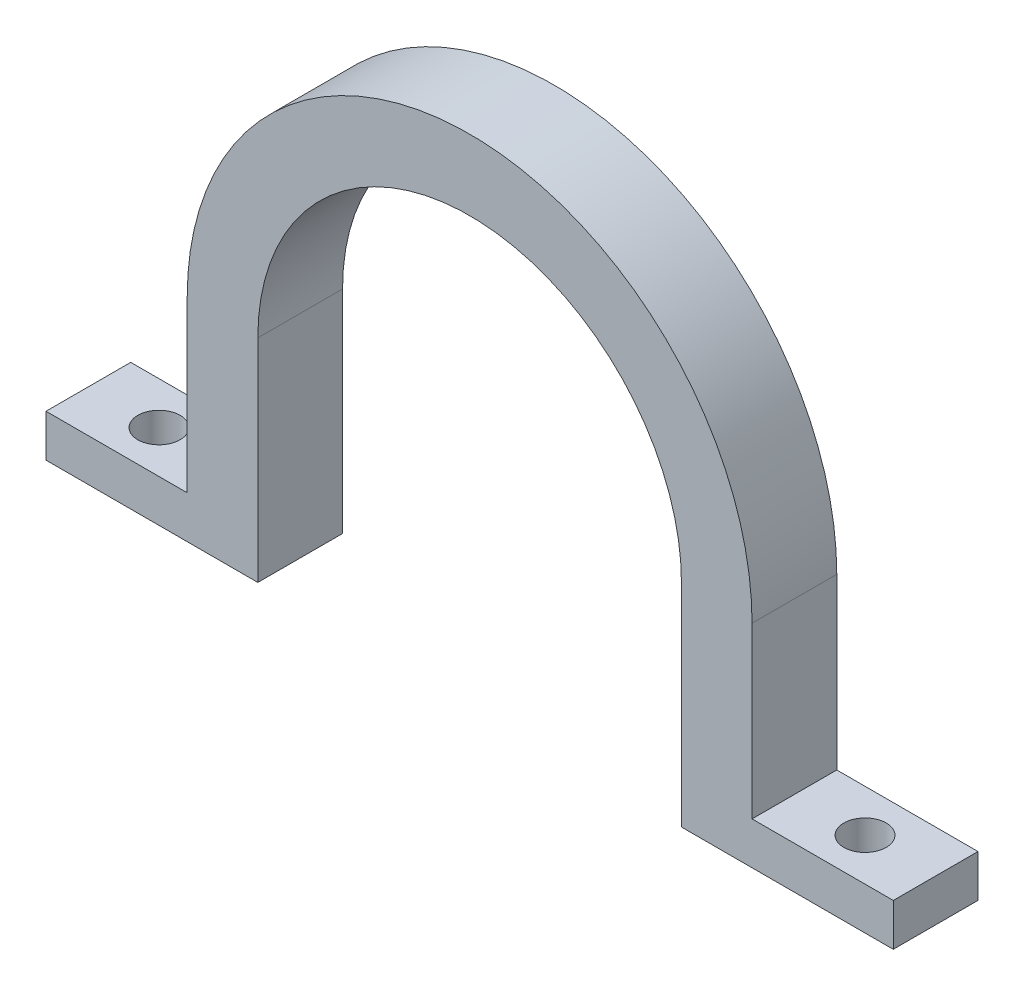
ISO-10303-21;
HEADER;
FILE_DESCRIPTION(('STEP AP214'),'2;1');
FILE_NAME('part.step','',(''),(''),'','','');
FILE_SCHEMA(('AUTOMOTIVE_DESIGN { 1 0 10303 214 1 1 1 1 }'));
ENDSEC;
DATA;
#1=APPLICATION_CONTEXT('core data for automotive mechanical design processes');
#2=APPLICATION_PROTOCOL_DEFINITION('international standard','automotive_design',2000,#1);
#3=PRODUCT_CONTEXT('',#1,'mechanical');
#4=PRODUCT('Part','Part','',(#3));
#5=PRODUCT_RELATED_PRODUCT_CATEGORY('part','',(#4));
#6=PRODUCT_DEFINITION_FORMATION('','',#4);
#7=PRODUCT_DEFINITION_CONTEXT('part definition',#1,'design');
#8=PRODUCT_DEFINITION('design','',#6,#7);
#9=PRODUCT_DEFINITION_SHAPE('','',#8);
#10=(LENGTH_UNIT() NAMED_UNIT(*) SI_UNIT(.MILLI.,.METRE.));
#11=(NAMED_UNIT(*) PLANE_ANGLE_UNIT() SI_UNIT($,.RADIAN.));
#12=(NAMED_UNIT(*) SI_UNIT($,.STERADIAN.) SOLID_ANGLE_UNIT());
#13=UNCERTAINTY_MEASURE_WITH_UNIT(LENGTH_MEASURE(1.E-05),#10,'distance_accuracy_value','');
#14=(GEOMETRIC_REPRESENTATION_CONTEXT(3) GLOBAL_UNCERTAINTY_ASSIGNED_CONTEXT((#13)) GLOBAL_UNIT_ASSIGNED_CONTEXT((#10,
#11,#12)) REPRESENTATION_CONTEXT('',''));
#15=CARTESIAN_POINT('',(0.,0.,0.));
#16=DIRECTION('',(0.,0.,1.));
#17=DIRECTION('',(1.,0.,0.));
#18=AXIS2_PLACEMENT_3D('',#15,#16,#17);
#19=CARTESIAN_POINT('',(15.,0.,6.));
#20=DIRECTION('',(1.,0.,0.));
#21=DIRECTION('',(0.,1.,0.));
#22=AXIS2_PLACEMENT_3D('',#19,#20,#21);
#23=PLANE('',#22);
#24=DIRECTION('',(0.,-1.,0.));
#25=VECTOR('',#24,1.);
#26=CARTESIAN_POINT('',(15.,0.,0.));
#27=LINE('',#26,#25);
#28=CARTESIAN_POINT('',(15.,0.,0.));
#29=VERTEX_POINT('',#28);
#30=CARTESIAN_POINT('',(15.0000000000001,-15.,0.));
#31=VERTEX_POINT('',#30);
#32=EDGE_CURVE('E156',#29,#31,#27,.T.);
#33=ORIENTED_EDGE('',*,*,#32,.T.);
#34=DIRECTION('',(0.,0.,-1.));
#35=VECTOR('',#34,1.);
#36=CARTESIAN_POINT('',(15.0000000000001,-15.,6.));
#37=LINE('',#36,#35);
#38=CARTESIAN_POINT('',(15.0000000000001,-15.,6.));
#39=VERTEX_POINT('',#38);
#40=EDGE_CURVE('E11',#39,#31,#37,.T.);
#41=ORIENTED_EDGE('',*,*,#40,.F.);
#42=DIRECTION('',(0.,-1.,0.));
#43=VECTOR('',#42,1.);
#44=CARTESIAN_POINT('',(15.,0.,6.));
#45=LINE('',#44,#43);
#46=CARTESIAN_POINT('',(15.,0.,6.));
#47=VERTEX_POINT('',#46);
#48=EDGE_CURVE('E188',#47,#39,#45,.T.);
#49=ORIENTED_EDGE('',*,*,#48,.F.);
#50=DIRECTION('',(0.,0.,-1.));
#51=VECTOR('',#50,1.);
#52=CARTESIAN_POINT('',(15.,0.,6.));
#53=LINE('',#52,#51);
#54=EDGE_CURVE('E51',#47,#29,#53,.T.);
#55=ORIENTED_EDGE('',*,*,#54,.T.);
#56=EDGE_LOOP('',(#33,#41,#49,#55));
#57=FACE_BOUND('',#56,.T.);
#58=ADVANCED_FACE('F35',(#57),#23,.F.);
#59=CARTESIAN_POINT('',(15.0000000000001,-15.,6.));
#60=DIRECTION('',(0.,1.,0.));
#61=DIRECTION('',(0.,0.,1.));
#62=AXIS2_PLACEMENT_3D('',#59,#60,#61);
#63=PLANE('',#62);
#64=CARTESIAN_POINT('',(25.,-15.,3.));
#65=DIRECTION('',(0.,1.,0.));
#66=DIRECTION('',(0.,0.,1.));
#67=AXIS2_PLACEMENT_3D('',#64,#65,#66);
#68=CIRCLE('',#67,1.5);
#69=CARTESIAN_POINT('',(25.,-15.,4.5));
#70=VERTEX_POINT('',#69);
#71=EDGE_CURVE('E296',#70,#70,#68,.T.);
#72=ORIENTED_EDGE('',*,*,#71,.T.);
#73=EDGE_LOOP('',(#72));
#74=FACE_BOUND('',#73,.T.);
#75=DIRECTION('',(1.,0.,0.));
#76=VECTOR('',#75,1.);
#77=CARTESIAN_POINT('',(15.0000000000001,-15.,0.));
#78=LINE('',#77,#76);
#79=CARTESIAN_POINT('',(30.,-15.,0.));
#80=VERTEX_POINT('',#79);
#81=EDGE_CURVE('E158',#31,#80,#78,.T.);
#82=ORIENTED_EDGE('',*,*,#81,.T.);
#83=DIRECTION('',(0.,0.,-1.));
#84=VECTOR('',#83,1.);
#85=CARTESIAN_POINT('',(30.,-15.,6.));
#86=LINE('',#85,#84);
#87=CARTESIAN_POINT('',(30.,-15.,6.));
#88=VERTEX_POINT('',#87);
#89=EDGE_CURVE('E43',#88,#80,#86,.T.);
#90=ORIENTED_EDGE('',*,*,#89,.F.);
#91=DIRECTION('',(1.,0.,0.));
#92=VECTOR('',#91,1.);
#93=CARTESIAN_POINT('',(15.0000000000001,-15.,6.));
#94=LINE('',#93,#92);
#95=EDGE_CURVE('E101',#39,#88,#94,.T.);
#96=ORIENTED_EDGE('',*,*,#95,.F.);
#97=ORIENTED_EDGE('',*,*,#40,.T.);
#98=EDGE_LOOP('',(#82,#90,#96,#97));
#99=FACE_BOUND('',#98,.T.);
#100=ADVANCED_FACE('F210',(#74,#99),#63,.F.);
#101=CARTESIAN_POINT('',(30.,-12.,6.));
#102=DIRECTION('',(1.,0.,0.));
#103=DIRECTION('',(0.,0.,-1.));
#104=AXIS2_PLACEMENT_3D('',#101,#102,#103);
#105=PLANE('',#104);
#106=DIRECTION('',(0.,-1.,0.));
#107=VECTOR('',#106,1.);
#108=CARTESIAN_POINT('',(30.,-12.,0.));
#109=LINE('',#108,#107);
#110=CARTESIAN_POINT('',(30.,-12.,0.));
#111=VERTEX_POINT('',#110);
#112=EDGE_CURVE('E162',#111,#80,#109,.T.);
#113=ORIENTED_EDGE('',*,*,#112,.F.);
#114=DIRECTION('',(0.,0.,-1.));
#115=VECTOR('',#114,1.);
#116=CARTESIAN_POINT('',(30.,-12.,6.));
#117=LINE('',#116,#115);
#118=CARTESIAN_POINT('',(30.,-12.,6.));
#119=VERTEX_POINT('',#118);
#120=EDGE_CURVE('E203',#119,#111,#117,.T.);
#121=ORIENTED_EDGE('',*,*,#120,.F.);
#122=DIRECTION('',(0.,-1.,0.));
#123=VECTOR('',#122,1.);
#124=CARTESIAN_POINT('',(30.,-12.,6.));
#125=LINE('',#124,#123);
#126=EDGE_CURVE('E209',#119,#88,#125,.T.);
#127=ORIENTED_EDGE('',*,*,#126,.T.);
#128=ORIENTED_EDGE('',*,*,#89,.T.);
#129=EDGE_LOOP('',(#113,#121,#127,#128));
#130=FACE_BOUND('',#129,.T.);
#131=ADVANCED_FACE('F207',(#130),#105,.T.);
#132=CARTESIAN_POINT('',(30.,-12.,6.));
#133=DIRECTION('',(0.,-1.,0.));
#134=DIRECTION('',(0.,0.,-1.));
#135=AXIS2_PLACEMENT_3D('',#132,#133,#134);
#136=PLANE('',#135);
#137=CARTESIAN_POINT('',(25.,-12.,3.));
#138=DIRECTION('',(0.,1.,0.));
#139=DIRECTION('',(0.,0.,1.));
#140=AXIS2_PLACEMENT_3D('',#137,#138,#139);
#141=CIRCLE('',#140,1.5);
#142=CARTESIAN_POINT('',(25.,-12.,4.5));
#143=VERTEX_POINT('',#142);
#144=EDGE_CURVE('E292',#143,#143,#141,.T.);
#145=ORIENTED_EDGE('',*,*,#144,.F.);
#146=EDGE_LOOP('',(#145));
#147=FACE_BOUND('',#146,.T.);
#148=DIRECTION('',(-1.,0.,0.));
#149=VECTOR('',#148,1.);
#150=CARTESIAN_POINT('',(30.,-12.,0.));
#151=LINE('',#150,#149);
#152=CARTESIAN_POINT('',(20.,-12.,0.));
#153=VERTEX_POINT('',#152);
#154=EDGE_CURVE('E165',#111,#153,#151,.T.);
#155=ORIENTED_EDGE('',*,*,#154,.T.);
#156=DIRECTION('',(0.,0.,-1.));
#157=VECTOR('',#156,1.);
#158=CARTESIAN_POINT('',(20.,-12.,6.));
#159=LINE('',#158,#157);
#160=CARTESIAN_POINT('',(20.,-12.,6.));
#161=VERTEX_POINT('',#160);
#162=EDGE_CURVE('E201',#161,#153,#159,.T.);
#163=ORIENTED_EDGE('',*,*,#162,.F.);
#164=DIRECTION('',(-1.,0.,0.));
#165=VECTOR('',#164,1.);
#166=CARTESIAN_POINT('',(30.,-12.,6.));
#167=LINE('',#166,#165);
#168=EDGE_CURVE('E222',#119,#161,#167,.T.);
#169=ORIENTED_EDGE('',*,*,#168,.F.);
#170=ORIENTED_EDGE('',*,*,#120,.T.);
#171=EDGE_LOOP('',(#155,#163,#169,#170));
#172=FACE_BOUND('',#171,.T.);
#173=ADVANCED_FACE('F219',(#147,#172),#136,.F.);
#174=CARTESIAN_POINT('',(20.,0.,6.));
#175=DIRECTION('',(1.,0.,0.));
#176=DIRECTION('',(0.,1.,0.));
#177=AXIS2_PLACEMENT_3D('',#174,#175,#176);
#178=PLANE('',#177);
#179=DIRECTION('',(0.,-1.,0.));
#180=VECTOR('',#179,1.);
#181=CARTESIAN_POINT('',(20.,0.,0.));
#182=LINE('',#181,#180);
#183=CARTESIAN_POINT('',(20.,0.,0.));
#184=VERTEX_POINT('',#183);
#185=EDGE_CURVE('E168',#184,#153,#182,.T.);
#186=ORIENTED_EDGE('',*,*,#185,.F.);
#187=DIRECTION('',(0.,0.,-1.));
#188=VECTOR('',#187,1.);
#189=CARTESIAN_POINT('',(20.,0.,6.));
#190=LINE('',#189,#188);
#191=CARTESIAN_POINT('',(20.,0.,6.));
#192=VERTEX_POINT('',#191);
#193=EDGE_CURVE('E199',#192,#184,#190,.T.);
#194=ORIENTED_EDGE('',*,*,#193,.F.);
#195=DIRECTION('',(0.,-1.,0.));
#196=VECTOR('',#195,1.);
#197=CARTESIAN_POINT('',(20.,0.,6.));
#198=LINE('',#197,#196);
#199=EDGE_CURVE('E224',#192,#161,#198,.T.);
#200=ORIENTED_EDGE('',*,*,#199,.T.);
#201=ORIENTED_EDGE('',*,*,#162,.T.);
#202=EDGE_LOOP('',(#186,#194,#200,#201));
#203=FACE_BOUND('',#202,.T.);
#204=ADVANCED_FACE('F305',(#203),#178,.T.);
#205=CARTESIAN_POINT('',(0.,0.,6.));
#206=DIRECTION('',(0.,0.,-1.));
#207=DIRECTION('',(-1.,0.,0.));
#208=AXIS2_PLACEMENT_3D('',#205,#206,#207);
#209=CYLINDRICAL_SURFACE('',#208,20.);
#210=CARTESIAN_POINT('',(0.,0.,0.));
#211=DIRECTION('',(0.,0.,1.));
#212=DIRECTION('',(1.,0.,0.));
#213=AXIS2_PLACEMENT_3D('',#210,#211,#212);
#214=CIRCLE('',#213,20.);
#215=CARTESIAN_POINT('',(-20.,0.,0.));
#216=VERTEX_POINT('',#215);
#217=EDGE_CURVE('E171',#184,#216,#214,.T.);
#218=ORIENTED_EDGE('',*,*,#217,.T.);
#219=DIRECTION('',(0.,0.,-1.));
#220=VECTOR('',#219,1.);
#221=CARTESIAN_POINT('',(-20.,0.,6.));
#222=LINE('',#221,#220);
#223=CARTESIAN_POINT('',(-20.,0.,6.));
#224=VERTEX_POINT('',#223);
#225=EDGE_CURVE('E196',#224,#216,#222,.T.);
#226=ORIENTED_EDGE('',*,*,#225,.F.);
#227=CARTESIAN_POINT('',(0.,0.,6.));
#228=DIRECTION('',(0.,0.,1.));
#229=DIRECTION('',(1.,0.,0.));
#230=AXIS2_PLACEMENT_3D('',#227,#228,#229);
#231=CIRCLE('',#230,20.);
#232=EDGE_CURVE('E231',#192,#224,#231,.T.);
#233=ORIENTED_EDGE('',*,*,#232,.F.);
#234=ORIENTED_EDGE('',*,*,#193,.T.);
#235=EDGE_LOOP('',(#218,#226,#233,#234));
#236=FACE_BOUND('',#235,.T.);
#237=ADVANCED_FACE('F311',(#236),#209,.T.);
#238=CARTESIAN_POINT('',(-20.,0.,6.));
#239=DIRECTION('',(1.,0.,0.));
#240=DIRECTION('',(0.,1.,0.));
#241=AXIS2_PLACEMENT_3D('',#238,#239,#240);
#242=PLANE('',#241);
#243=DIRECTION('',(0.,-1.,0.));
#244=VECTOR('',#243,1.);
#245=CARTESIAN_POINT('',(-20.,0.,0.));
#246=LINE('',#245,#244);
#247=CARTESIAN_POINT('',(-20.,-12.0000000000002,0.));
#248=VERTEX_POINT('',#247);
#249=EDGE_CURVE('E173',#216,#248,#246,.T.);
#250=ORIENTED_EDGE('',*,*,#249,.T.);
#251=DIRECTION('',(0.,0.,-1.));
#252=VECTOR('',#251,1.);
#253=CARTESIAN_POINT('',(-20.,-12.0000000000002,6.));
#254=LINE('',#253,#252);
#255=CARTESIAN_POINT('',(-20.,-12.0000000000002,6.));
#256=VERTEX_POINT('',#255);
#257=EDGE_CURVE('E194',#256,#248,#254,.T.);
#258=ORIENTED_EDGE('',*,*,#257,.F.);
#259=DIRECTION('',(0.,-1.,0.));
#260=VECTOR('',#259,1.);
#261=CARTESIAN_POINT('',(-20.,0.,6.));
#262=LINE('',#261,#260);
#263=EDGE_CURVE('E233',#224,#256,#262,.T.);
#264=ORIENTED_EDGE('',*,*,#263,.F.);
#265=ORIENTED_EDGE('',*,*,#225,.T.);
#266=EDGE_LOOP('',(#250,#258,#264,#265));
#267=FACE_BOUND('',#266,.T.);
#268=ADVANCED_FACE('F245',(#267),#242,.F.);
#269=CARTESIAN_POINT('',(-30.,-12.0000000000002,6.));
#270=DIRECTION('',(0.,1.,0.));
#271=DIRECTION('',(0.,0.,1.));
#272=AXIS2_PLACEMENT_3D('',#269,#270,#271);
#273=PLANE('',#272);
#274=CARTESIAN_POINT('',(-25.,-12.,3.));
#275=DIRECTION('',(0.,1.,0.));
#276=DIRECTION('',(0.,0.,1.));
#277=AXIS2_PLACEMENT_3D('',#274,#275,#276);
#278=CIRCLE('',#277,1.5);
#279=CARTESIAN_POINT('',(-25.,-12.,4.5));
#280=VERTEX_POINT('',#279);
#281=EDGE_CURVE('E291',#280,#280,#278,.T.);
#282=ORIENTED_EDGE('',*,*,#281,.F.);
#283=EDGE_LOOP('',(#282));
#284=FACE_BOUND('',#283,.T.);
#285=DIRECTION('',(1.,0.,0.));
#286=VECTOR('',#285,1.);
#287=CARTESIAN_POINT('',(-30.,-12.0000000000002,0.));
#288=LINE('',#287,#286);
#289=CARTESIAN_POINT('',(-30.,-12.0000000000002,0.));
#290=VERTEX_POINT('',#289);
#291=EDGE_CURVE('E176',#290,#248,#288,.T.);
#292=ORIENTED_EDGE('',*,*,#291,.F.);
#293=DIRECTION('',(0.,0.,-1.));
#294=VECTOR('',#293,1.);
#295=CARTESIAN_POINT('',(-30.,-12.0000000000002,6.));
#296=LINE('',#295,#294);
#297=CARTESIAN_POINT('',(-30.,-12.0000000000002,6.));
#298=VERTEX_POINT('',#297);
#299=EDGE_CURVE('E192',#298,#290,#296,.T.);
#300=ORIENTED_EDGE('',*,*,#299,.F.);
#301=DIRECTION('',(1.,0.,0.));
#302=VECTOR('',#301,1.);
#303=CARTESIAN_POINT('',(-30.,-12.0000000000002,6.));
#304=LINE('',#303,#302);
#305=EDGE_CURVE('E235',#298,#256,#304,.T.);
#306=ORIENTED_EDGE('',*,*,#305,.T.);
#307=ORIENTED_EDGE('',*,*,#257,.T.);
#308=EDGE_LOOP('',(#292,#300,#306,#307));
#309=FACE_BOUND('',#308,.T.);
#310=ADVANCED_FACE('F239',(#284,#309),#273,.T.);
#311=CARTESIAN_POINT('',(-30.,-12.0000000000002,6.));
#312=DIRECTION('',(1.,0.,0.));
#313=DIRECTION('',(0.,0.,-1.));
#314=AXIS2_PLACEMENT_3D('',#311,#312,#313);
#315=PLANE('',#314);
#316=DIRECTION('',(0.,-1.,0.));
#317=VECTOR('',#316,1.);
#318=CARTESIAN_POINT('',(-30.,-12.0000000000002,0.));
#319=LINE('',#318,#317);
#320=CARTESIAN_POINT('',(-30.,-15.,0.));
#321=VERTEX_POINT('',#320);
#322=EDGE_CURVE('E179',#290,#321,#319,.T.);
#323=ORIENTED_EDGE('',*,*,#322,.T.);
#324=DIRECTION('',(0.,0.,-1.));
#325=VECTOR('',#324,1.);
#326=CARTESIAN_POINT('',(-30.,-15.,6.));
#327=LINE('',#326,#325);
#328=CARTESIAN_POINT('',(-30.,-15.,6.));
#329=VERTEX_POINT('',#328);
#330=EDGE_CURVE('E138',#329,#321,#327,.T.);
#331=ORIENTED_EDGE('',*,*,#330,.F.);
#332=DIRECTION('',(0.,-1.,0.));
#333=VECTOR('',#332,1.);
#334=CARTESIAN_POINT('',(-30.,-12.0000000000002,6.));
#335=LINE('',#334,#333);
#336=EDGE_CURVE('E147',#298,#329,#335,.T.);
#337=ORIENTED_EDGE('',*,*,#336,.F.);
#338=ORIENTED_EDGE('',*,*,#299,.T.);
#339=EDGE_LOOP('',(#323,#331,#337,#338));
#340=FACE_BOUND('',#339,.T.);
#341=ADVANCED_FACE('F249',(#340),#315,.F.);
#342=CARTESIAN_POINT('',(-14.9999999999999,-15.,6.));
#343=DIRECTION('',(0.,-1.,0.));
#344=DIRECTION('',(0.,0.,-1.));
#345=AXIS2_PLACEMENT_3D('',#342,#343,#344);
#346=PLANE('',#345);
#347=CARTESIAN_POINT('',(-25.,-15.,3.));
#348=DIRECTION('',(0.,1.,0.));
#349=DIRECTION('',(0.,0.,1.));
#350=AXIS2_PLACEMENT_3D('',#347,#348,#349);
#351=CIRCLE('',#350,1.5);
#352=CARTESIAN_POINT('',(-25.,-15.,4.5));
#353=VERTEX_POINT('',#352);
#354=EDGE_CURVE('E159',#353,#353,#351,.T.);
#355=ORIENTED_EDGE('',*,*,#354,.T.);
#356=EDGE_LOOP('',(#355));
#357=FACE_BOUND('',#356,.T.);
#358=DIRECTION('',(-1.,0.,0.));
#359=VECTOR('',#358,1.);
#360=CARTESIAN_POINT('',(-14.9999999999999,-15.,0.));
#361=LINE('',#360,#359);
#362=CARTESIAN_POINT('',(-14.9999999999999,-15.,0.));
#363=VERTEX_POINT('',#362);
#364=EDGE_CURVE('E134',#363,#321,#361,.T.);
#365=ORIENTED_EDGE('',*,*,#364,.F.);
#366=DIRECTION('',(0.,0.,-1.));
#367=VECTOR('',#366,1.);
#368=CARTESIAN_POINT('',(-14.9999999999999,-15.,6.));
#369=LINE('',#368,#367);
#370=CARTESIAN_POINT('',(-14.9999999999999,-15.,6.));
#371=VERTEX_POINT('',#370);
#372=EDGE_CURVE('E129',#371,#363,#369,.T.);
#373=ORIENTED_EDGE('',*,*,#372,.F.);
#374=DIRECTION('',(-1.,0.,0.));
#375=VECTOR('',#374,1.);
#376=CARTESIAN_POINT('',(-14.9999999999999,-15.,6.));
#377=LINE('',#376,#375);
#378=EDGE_CURVE('E132',#371,#329,#377,.T.);
#379=ORIENTED_EDGE('',*,*,#378,.T.);
#380=ORIENTED_EDGE('',*,*,#330,.T.);
#381=EDGE_LOOP('',(#365,#373,#379,#380));
#382=FACE_BOUND('',#381,.T.);
#383=ADVANCED_FACE('F131',(#357,#382),#346,.T.);
#384=CARTESIAN_POINT('',(-15.,0.,6.));
#385=DIRECTION('',(1.,0.,0.));
#386=DIRECTION('',(0.,1.,0.));
#387=AXIS2_PLACEMENT_3D('',#384,#385,#386);
#388=PLANE('',#387);
#389=DIRECTION('',(0.,-1.,0.));
#390=VECTOR('',#389,1.);
#391=CARTESIAN_POINT('',(-15.,0.,0.));
#392=LINE('',#391,#390);
#393=CARTESIAN_POINT('',(-15.,0.,0.));
#394=VERTEX_POINT('',#393);
#395=EDGE_CURVE('E183',#394,#363,#392,.T.);
#396=ORIENTED_EDGE('',*,*,#395,.F.);
#397=DIRECTION('',(0.,0.,-1.));
#398=VECTOR('',#397,1.);
#399=CARTESIAN_POINT('',(-15.,0.,6.));
#400=LINE('',#399,#398);
#401=CARTESIAN_POINT('',(-15.,0.,6.));
#402=VERTEX_POINT('',#401);
#403=EDGE_CURVE('E89',#402,#394,#400,.T.);
#404=ORIENTED_EDGE('',*,*,#403,.F.);
#405=DIRECTION('',(0.,-1.,0.));
#406=VECTOR('',#405,1.);
#407=CARTESIAN_POINT('',(-15.,0.,6.));
#408=LINE('',#407,#406);
#409=EDGE_CURVE('E144',#402,#371,#408,.T.);
#410=ORIENTED_EDGE('',*,*,#409,.T.);
#411=ORIENTED_EDGE('',*,*,#372,.T.);
#412=EDGE_LOOP('',(#396,#404,#410,#411));
#413=FACE_BOUND('',#412,.T.);
#414=ADVANCED_FACE('F150',(#413),#388,.T.);
#415=CARTESIAN_POINT('',(0.,0.,6.));
#416=DIRECTION('',(0.,0.,-1.));
#417=DIRECTION('',(-1.,0.,0.));
#418=AXIS2_PLACEMENT_3D('',#415,#416,#417);
#419=CYLINDRICAL_SURFACE('',#418,15.);
#420=CARTESIAN_POINT('',(0.,0.,0.));
#421=DIRECTION('',(0.,0.,1.));
#422=DIRECTION('',(1.,0.,0.));
#423=AXIS2_PLACEMENT_3D('',#420,#421,#422);
#424=CIRCLE('',#423,15.);
#425=EDGE_CURVE('E185',#29,#394,#424,.T.);
#426=ORIENTED_EDGE('',*,*,#425,.F.);
#427=ORIENTED_EDGE('',*,*,#54,.F.);
#428=CARTESIAN_POINT('',(0.,0.,6.));
#429=DIRECTION('',(0.,0.,1.));
#430=DIRECTION('',(1.,0.,0.));
#431=AXIS2_PLACEMENT_3D('',#428,#429,#430);
#432=CIRCLE('',#431,15.);
#433=EDGE_CURVE('E151',#47,#402,#432,.T.);
#434=ORIENTED_EDGE('',*,*,#433,.T.);
#435=ORIENTED_EDGE('',*,*,#403,.T.);
#436=EDGE_LOOP('',(#426,#427,#434,#435));
#437=FACE_BOUND('',#436,.T.);
#438=ADVANCED_FACE('F265',(#437),#419,.F.);
#439=CARTESIAN_POINT('',(0.,0.,6.));
#440=DIRECTION('',(0.,0.,1.));
#441=DIRECTION('',(1.,0.,0.));
#442=AXIS2_PLACEMENT_3D('',#439,#440,#441);
#443=PLANE('',#442);
#444=ORIENTED_EDGE('',*,*,#48,.T.);
#445=ORIENTED_EDGE('',*,*,#95,.T.);
#446=ORIENTED_EDGE('',*,*,#126,.F.);
#447=ORIENTED_EDGE('',*,*,#168,.T.);
#448=ORIENTED_EDGE('',*,*,#199,.F.);
#449=ORIENTED_EDGE('',*,*,#232,.T.);
#450=ORIENTED_EDGE('',*,*,#263,.T.);
#451=ORIENTED_EDGE('',*,*,#305,.F.);
#452=ORIENTED_EDGE('',*,*,#336,.T.);
#453=ORIENTED_EDGE('',*,*,#378,.F.);
#454=ORIENTED_EDGE('',*,*,#409,.F.);
#455=ORIENTED_EDGE('',*,*,#433,.F.);
#456=EDGE_LOOP('',(#444,#445,#446,#447,#448,#449,#450,#451,#452,#453,#454,#455));
#457=FACE_BOUND('',#456,.T.);
#458=ADVANCED_FACE('F142',(#457),#443,.T.);
#459=CARTESIAN_POINT('',(0.,0.,0.));
#460=DIRECTION('',(0.,0.,1.));
#461=DIRECTION('',(1.,0.,0.));
#462=AXIS2_PLACEMENT_3D('',#459,#460,#461);
#463=PLANE('',#462);
#464=ORIENTED_EDGE('',*,*,#32,.F.);
#465=ORIENTED_EDGE('',*,*,#425,.T.);
#466=ORIENTED_EDGE('',*,*,#395,.T.);
#467=ORIENTED_EDGE('',*,*,#364,.T.);
#468=ORIENTED_EDGE('',*,*,#322,.F.);
#469=ORIENTED_EDGE('',*,*,#291,.T.);
#470=ORIENTED_EDGE('',*,*,#249,.F.);
#471=ORIENTED_EDGE('',*,*,#217,.F.);
#472=ORIENTED_EDGE('',*,*,#185,.T.);
#473=ORIENTED_EDGE('',*,*,#154,.F.);
#474=ORIENTED_EDGE('',*,*,#112,.T.);
#475=ORIENTED_EDGE('',*,*,#81,.F.);
#476=EDGE_LOOP('',(#464,#465,#466,#467,#468,#469,#470,#471,#472,#473,#474,#475));
#477=FACE_BOUND('',#476,.T.);
#478=ADVANCED_FACE('F214',(#477),#463,.F.);
#479=CARTESIAN_POINT('',(-25.,-15.,3.));
#480=DIRECTION('',(0.,1.,0.));
#481=DIRECTION('',(0.,0.,1.));
#482=AXIS2_PLACEMENT_3D('',#479,#480,#481);
#483=CYLINDRICAL_SURFACE('',#482,1.5);
#484=ORIENTED_EDGE('',*,*,#354,.F.);
#485=EDGE_LOOP('',(#484));
#486=FACE_BOUND('',#485,.T.);
#487=ORIENTED_EDGE('',*,*,#281,.T.);
#488=EDGE_LOOP('',(#487));
#489=FACE_BOUND('',#488,.T.);
#490=ADVANCED_FACE('F276',(#486,#489),#483,.F.);
#491=CARTESIAN_POINT('',(25.,-15.,3.));
#492=DIRECTION('',(0.,1.,0.));
#493=DIRECTION('',(0.,0.,1.));
#494=AXIS2_PLACEMENT_3D('',#491,#492,#493);
#495=CYLINDRICAL_SURFACE('',#494,1.5);
#496=ORIENTED_EDGE('',*,*,#71,.F.);
#497=EDGE_LOOP('',(#496));
#498=FACE_BOUND('',#497,.T.);
#499=ORIENTED_EDGE('',*,*,#144,.T.);
#500=EDGE_LOOP('',(#499));
#501=FACE_BOUND('',#500,.T.);
#502=ADVANCED_FACE('F278',(#498,#501),#495,.F.);
#503=CLOSED_SHELL('',(#58,#100,#131,#173,#204,#237,#268,#310,#341,#383,#414,#438,#458,#478,#490,#502));
#504=MANIFOLD_SOLID_BREP('B2',#503);
#505=ADVANCED_BREP_SHAPE_REPRESENTATION('',(#18,#504),#14);
#506=SHAPE_DEFINITION_REPRESENTATION(#9,#505);
ENDSEC;
END-ISO-10303-21;
